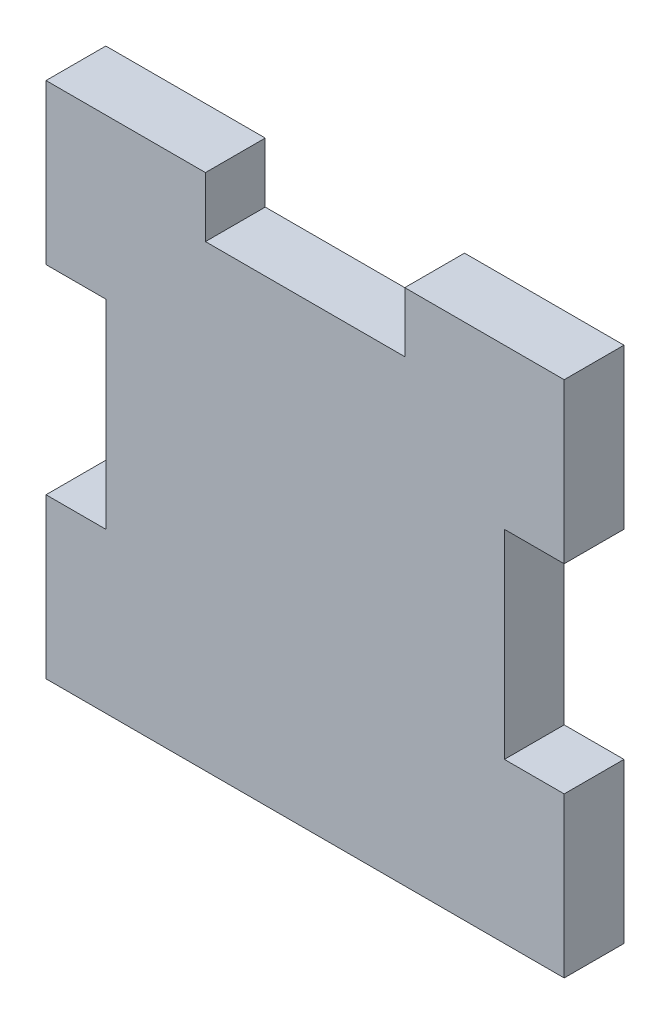
ISO-10303-21;
HEADER;
FILE_DESCRIPTION(('STEP AP214'),'2;1');
FILE_NAME('part.step','',(''),(''),'','','');
FILE_SCHEMA(('AUTOMOTIVE_DESIGN { 1 0 10303 214 1 1 1 1 }'));
ENDSEC;
DATA;
#1=APPLICATION_CONTEXT('core data for automotive mechanical design processes');
#2=APPLICATION_PROTOCOL_DEFINITION('international standard','automotive_design',2000,#1);
#3=PRODUCT_CONTEXT('',#1,'mechanical');
#4=PRODUCT('Part','Part','',(#3));
#5=PRODUCT_RELATED_PRODUCT_CATEGORY('part','',(#4));
#6=PRODUCT_DEFINITION_FORMATION('','',#4);
#7=PRODUCT_DEFINITION_CONTEXT('part definition',#1,'design');
#8=PRODUCT_DEFINITION('design','',#6,#7);
#9=PRODUCT_DEFINITION_SHAPE('','',#8);
#10=(LENGTH_UNIT() NAMED_UNIT(*) SI_UNIT(.MILLI.,.METRE.));
#11=(NAMED_UNIT(*) PLANE_ANGLE_UNIT() SI_UNIT($,.RADIAN.));
#12=(NAMED_UNIT(*) SI_UNIT($,.STERADIAN.) SOLID_ANGLE_UNIT());
#13=UNCERTAINTY_MEASURE_WITH_UNIT(LENGTH_MEASURE(1.E-05),#10,'distance_accuracy_value','');
#14=(GEOMETRIC_REPRESENTATION_CONTEXT(3) GLOBAL_UNCERTAINTY_ASSIGNED_CONTEXT((#13)) GLOBAL_UNIT_ASSIGNED_CONTEXT((#10,
#11,#12)) REPRESENTATION_CONTEXT('',''));
#15=CARTESIAN_POINT('',(0.,0.,0.));
#16=DIRECTION('',(0.,0.,1.));
#17=DIRECTION('',(1.,0.,0.));
#18=AXIS2_PLACEMENT_3D('',#15,#16,#17);
#19=CARTESIAN_POINT('',(0.,0.,3.));
#20=DIRECTION('',(1.,0.,0.));
#21=DIRECTION('',(0.,0.,-1.));
#22=AXIS2_PLACEMENT_3D('',#19,#20,#21);
#23=PLANE('',#22);
#24=DIRECTION('',(0.,-1.,0.));
#25=VECTOR('',#24,1.);
#26=CARTESIAN_POINT('',(0.,0.,0.));
#27=LINE('',#26,#25);
#28=CARTESIAN_POINT('',(0.,8.,0.));
#29=VERTEX_POINT('',#28);
#30=CARTESIAN_POINT('',(0.,0.,0.));
#31=VERTEX_POINT('',#30);
#32=EDGE_CURVE('E177',#29,#31,#27,.T.);
#33=ORIENTED_EDGE('',*,*,#32,.T.);
#34=DIRECTION('',(0.,0.,-1.));
#35=VECTOR('',#34,1.);
#36=CARTESIAN_POINT('',(0.,0.,3.));
#37=LINE('',#36,#35);
#38=CARTESIAN_POINT('',(0.,0.,3.));
#39=VERTEX_POINT('',#38);
#40=EDGE_CURVE('E11',#39,#31,#37,.T.);
#41=ORIENTED_EDGE('',*,*,#40,.F.);
#42=DIRECTION('',(0.,-1.,0.));
#43=VECTOR('',#42,1.);
#44=CARTESIAN_POINT('',(0.,0.,3.));
#45=LINE('',#44,#43);
#46=CARTESIAN_POINT('',(0.,8.,3.));
#47=VERTEX_POINT('',#46);
#48=EDGE_CURVE('E207',#47,#39,#45,.T.);
#49=ORIENTED_EDGE('',*,*,#48,.F.);
#50=DIRECTION('',(0.,0.,-1.));
#51=VECTOR('',#50,1.);
#52=CARTESIAN_POINT('',(0.,8.,3.));
#53=LINE('',#52,#51);
#54=EDGE_CURVE('E173',#47,#29,#53,.T.);
#55=ORIENTED_EDGE('',*,*,#54,.T.);
#56=EDGE_LOOP('',(#33,#41,#49,#55));
#57=FACE_BOUND('',#56,.T.);
#58=ADVANCED_FACE('F33',(#57),#23,.F.);
#59=CARTESIAN_POINT('',(0.,0.,3.));
#60=DIRECTION('',(0.,1.,0.));
#61=DIRECTION('',(0.,0.,1.));
#62=AXIS2_PLACEMENT_3D('',#59,#60,#61);
#63=PLANE('',#62);
#64=DIRECTION('',(1.,0.,0.));
#65=VECTOR('',#64,1.);
#66=CARTESIAN_POINT('',(0.,0.,0.));
#67=LINE('',#66,#65);
#68=CARTESIAN_POINT('',(26.,0.,0.));
#69=VERTEX_POINT('',#68);
#70=EDGE_CURVE('E180',#31,#69,#67,.T.);
#71=ORIENTED_EDGE('',*,*,#70,.T.);
#72=DIRECTION('',(0.,0.,-1.));
#73=VECTOR('',#72,1.);
#74=CARTESIAN_POINT('',(26.,0.,3.));
#75=LINE('',#74,#73);
#76=CARTESIAN_POINT('',(26.,0.,3.));
#77=VERTEX_POINT('',#76);
#78=EDGE_CURVE('E41',#77,#69,#75,.T.);
#79=ORIENTED_EDGE('',*,*,#78,.F.);
#80=DIRECTION('',(1.,0.,0.));
#81=VECTOR('',#80,1.);
#82=CARTESIAN_POINT('',(0.,0.,3.));
#83=LINE('',#82,#81);
#84=EDGE_CURVE('E116',#39,#77,#83,.T.);
#85=ORIENTED_EDGE('',*,*,#84,.F.);
#86=ORIENTED_EDGE('',*,*,#40,.T.);
#87=EDGE_LOOP('',(#71,#79,#85,#86));
#88=FACE_BOUND('',#87,.T.);
#89=ADVANCED_FACE('F305',(#88),#63,.F.);
#90=CARTESIAN_POINT('',(26.,0.,3.));
#91=DIRECTION('',(-1.,0.,0.));
#92=DIRECTION('',(0.,-1.,0.));
#93=AXIS2_PLACEMENT_3D('',#90,#91,#92);
#94=PLANE('',#93);
#95=DIRECTION('',(0.,1.,0.));
#96=VECTOR('',#95,1.);
#97=CARTESIAN_POINT('',(26.,0.,0.));
#98=LINE('',#97,#96);
#99=CARTESIAN_POINT('',(26.,8.,0.));
#100=VERTEX_POINT('',#99);
#101=EDGE_CURVE('E182',#69,#100,#98,.T.);
#102=ORIENTED_EDGE('',*,*,#101,.T.);
#103=DIRECTION('',(0.,0.,-1.));
#104=VECTOR('',#103,1.);
#105=CARTESIAN_POINT('',(26.,8.,3.));
#106=LINE('',#105,#104);
#107=CARTESIAN_POINT('',(26.,8.,3.));
#108=VERTEX_POINT('',#107);
#109=EDGE_CURVE('E238',#108,#100,#106,.T.);
#110=ORIENTED_EDGE('',*,*,#109,.F.);
#111=DIRECTION('',(0.,1.,0.));
#112=VECTOR('',#111,1.);
#113=CARTESIAN_POINT('',(26.,0.,3.));
#114=LINE('',#113,#112);
#115=EDGE_CURVE('E246',#77,#108,#114,.T.);
#116=ORIENTED_EDGE('',*,*,#115,.F.);
#117=ORIENTED_EDGE('',*,*,#78,.T.);
#118=EDGE_LOOP('',(#102,#110,#116,#117));
#119=FACE_BOUND('',#118,.T.);
#120=ADVANCED_FACE('F244',(#119),#94,.F.);
#121=CARTESIAN_POINT('',(26.,8.,3.));
#122=DIRECTION('',(0.,-1.,0.));
#123=DIRECTION('',(0.,0.,-1.));
#124=AXIS2_PLACEMENT_3D('',#121,#122,#123);
#125=PLANE('',#124);
#126=DIRECTION('',(-1.,0.,0.));
#127=VECTOR('',#126,1.);
#128=CARTESIAN_POINT('',(26.,8.,0.));
#129=LINE('',#128,#127);
#130=CARTESIAN_POINT('',(23.,8.,0.));
#131=VERTEX_POINT('',#130);
#132=EDGE_CURVE('E184',#100,#131,#129,.T.);
#133=ORIENTED_EDGE('',*,*,#132,.T.);
#134=DIRECTION('',(0.,0.,-1.));
#135=VECTOR('',#134,1.);
#136=CARTESIAN_POINT('',(23.,8.,3.));
#137=LINE('',#136,#135);
#138=CARTESIAN_POINT('',(23.,8.,3.));
#139=VERTEX_POINT('',#138);
#140=EDGE_CURVE('E235',#139,#131,#137,.T.);
#141=ORIENTED_EDGE('',*,*,#140,.F.);
#142=DIRECTION('',(-1.,0.,0.));
#143=VECTOR('',#142,1.);
#144=CARTESIAN_POINT('',(26.,8.,3.));
#145=LINE('',#144,#143);
#146=EDGE_CURVE('E264',#108,#139,#145,.T.);
#147=ORIENTED_EDGE('',*,*,#146,.F.);
#148=ORIENTED_EDGE('',*,*,#109,.T.);
#149=EDGE_LOOP('',(#133,#141,#147,#148));
#150=FACE_BOUND('',#149,.T.);
#151=ADVANCED_FACE('F255',(#150),#125,.F.);
#152=CARTESIAN_POINT('',(23.,18.,3.));
#153=DIRECTION('',(-1.,0.,0.));
#154=DIRECTION('',(0.,0.,1.));
#155=AXIS2_PLACEMENT_3D('',#152,#153,#154);
#156=PLANE('',#155);
#157=DIRECTION('',(0.,1.,0.));
#158=VECTOR('',#157,1.);
#159=CARTESIAN_POINT('',(23.,18.,0.));
#160=LINE('',#159,#158);
#161=CARTESIAN_POINT('',(23.,18.,0.));
#162=VERTEX_POINT('',#161);
#163=EDGE_CURVE('E186',#131,#162,#160,.T.);
#164=ORIENTED_EDGE('',*,*,#163,.T.);
#165=DIRECTION('',(0.,0.,-1.));
#166=VECTOR('',#165,1.);
#167=CARTESIAN_POINT('',(23.,18.,3.));
#168=LINE('',#167,#166);
#169=CARTESIAN_POINT('',(23.,18.,3.));
#170=VERTEX_POINT('',#169);
#171=EDGE_CURVE('E232',#170,#162,#168,.T.);
#172=ORIENTED_EDGE('',*,*,#171,.F.);
#173=DIRECTION('',(0.,1.,0.));
#174=VECTOR('',#173,1.);
#175=CARTESIAN_POINT('',(23.,18.,3.));
#176=LINE('',#175,#174);
#177=EDGE_CURVE('E261',#139,#170,#176,.T.);
#178=ORIENTED_EDGE('',*,*,#177,.F.);
#179=ORIENTED_EDGE('',*,*,#140,.T.);
#180=EDGE_LOOP('',(#164,#172,#178,#179));
#181=FACE_BOUND('',#180,.T.);
#182=ADVANCED_FACE('F259',(#181),#156,.F.);
#183=CARTESIAN_POINT('',(26.,18.,3.));
#184=DIRECTION('',(0.,1.,0.));
#185=DIRECTION('',(0.,0.,1.));
#186=AXIS2_PLACEMENT_3D('',#183,#184,#185);
#187=PLANE('',#186);
#188=DIRECTION('',(1.,0.,0.));
#189=VECTOR('',#188,1.);
#190=CARTESIAN_POINT('',(26.,18.,0.));
#191=LINE('',#190,#189);
#192=CARTESIAN_POINT('',(26.,18.,0.));
#193=VERTEX_POINT('',#192);
#194=EDGE_CURVE('E188',#162,#193,#191,.T.);
#195=ORIENTED_EDGE('',*,*,#194,.T.);
#196=DIRECTION('',(0.,0.,-1.));
#197=VECTOR('',#196,1.);
#198=CARTESIAN_POINT('',(26.,18.,3.));
#199=LINE('',#198,#197);
#200=CARTESIAN_POINT('',(26.,18.,3.));
#201=VERTEX_POINT('',#200);
#202=EDGE_CURVE('E229',#201,#193,#199,.T.);
#203=ORIENTED_EDGE('',*,*,#202,.F.);
#204=DIRECTION('',(1.,0.,0.));
#205=VECTOR('',#204,1.);
#206=CARTESIAN_POINT('',(26.,18.,3.));
#207=LINE('',#206,#205);
#208=EDGE_CURVE('E263',#170,#201,#207,.T.);
#209=ORIENTED_EDGE('',*,*,#208,.F.);
#210=ORIENTED_EDGE('',*,*,#171,.T.);
#211=EDGE_LOOP('',(#195,#203,#209,#210));
#212=FACE_BOUND('',#211,.T.);
#213=ADVANCED_FACE('F318',(#212),#187,.F.);
#214=CARTESIAN_POINT('',(26.,18.,3.));
#215=DIRECTION('',(-1.,0.,0.));
#216=DIRECTION('',(0.,0.,1.));
#217=AXIS2_PLACEMENT_3D('',#214,#215,#216);
#218=PLANE('',#217);
#219=DIRECTION('',(0.,1.,0.));
#220=VECTOR('',#219,1.);
#221=CARTESIAN_POINT('',(26.,18.,0.));
#222=LINE('',#221,#220);
#223=CARTESIAN_POINT('',(26.,26.,0.));
#224=VERTEX_POINT('',#223);
#225=EDGE_CURVE('E190',#193,#224,#222,.T.);
#226=ORIENTED_EDGE('',*,*,#225,.T.);
#227=DIRECTION('',(0.,0.,-1.));
#228=VECTOR('',#227,1.);
#229=CARTESIAN_POINT('',(26.,26.,3.));
#230=LINE('',#229,#228);
#231=CARTESIAN_POINT('',(26.,26.,3.));
#232=VERTEX_POINT('',#231);
#233=EDGE_CURVE('E226',#232,#224,#230,.T.);
#234=ORIENTED_EDGE('',*,*,#233,.F.);
#235=DIRECTION('',(0.,1.,0.));
#236=VECTOR('',#235,1.);
#237=CARTESIAN_POINT('',(26.,18.,3.));
#238=LINE('',#237,#236);
#239=EDGE_CURVE('E266',#201,#232,#238,.T.);
#240=ORIENTED_EDGE('',*,*,#239,.F.);
#241=ORIENTED_EDGE('',*,*,#202,.T.);
#242=EDGE_LOOP('',(#226,#234,#240,#241));
#243=FACE_BOUND('',#242,.T.);
#244=ADVANCED_FACE('F321',(#243),#218,.F.);
#245=CARTESIAN_POINT('',(18.,26.,3.));
#246=DIRECTION('',(0.,-1.,0.));
#247=DIRECTION('',(0.,0.,-1.));
#248=AXIS2_PLACEMENT_3D('',#245,#246,#247);
#249=PLANE('',#248);
#250=DIRECTION('',(-1.,0.,0.));
#251=VECTOR('',#250,1.);
#252=CARTESIAN_POINT('',(18.,26.,0.));
#253=LINE('',#252,#251);
#254=CARTESIAN_POINT('',(18.,26.,0.));
#255=VERTEX_POINT('',#254);
#256=EDGE_CURVE('E192',#224,#255,#253,.T.);
#257=ORIENTED_EDGE('',*,*,#256,.T.);
#258=DIRECTION('',(0.,0.,-1.));
#259=VECTOR('',#258,1.);
#260=CARTESIAN_POINT('',(18.,26.,3.));
#261=LINE('',#260,#259);
#262=CARTESIAN_POINT('',(18.,26.,3.));
#263=VERTEX_POINT('',#262);
#264=EDGE_CURVE('E223',#263,#255,#261,.T.);
#265=ORIENTED_EDGE('',*,*,#264,.F.);
#266=DIRECTION('',(-1.,0.,0.));
#267=VECTOR('',#266,1.);
#268=CARTESIAN_POINT('',(18.,26.,3.));
#269=LINE('',#268,#267);
#270=EDGE_CURVE('E272',#232,#263,#269,.T.);
#271=ORIENTED_EDGE('',*,*,#270,.F.);
#272=ORIENTED_EDGE('',*,*,#233,.T.);
#273=EDGE_LOOP('',(#257,#265,#271,#272));
#274=FACE_BOUND('',#273,.T.);
#275=ADVANCED_FACE('F325',(#274),#249,.F.);
#276=CARTESIAN_POINT('',(18.,26.,3.));
#277=DIRECTION('',(1.,0.,0.));
#278=DIRECTION('',(0.,0.,-1.));
#279=AXIS2_PLACEMENT_3D('',#276,#277,#278);
#280=PLANE('',#279);
#281=DIRECTION('',(0.,-1.,0.));
#282=VECTOR('',#281,1.);
#283=CARTESIAN_POINT('',(18.,26.,0.));
#284=LINE('',#283,#282);
#285=CARTESIAN_POINT('',(18.,23.,0.));
#286=VERTEX_POINT('',#285);
#287=EDGE_CURVE('E194',#255,#286,#284,.T.);
#288=ORIENTED_EDGE('',*,*,#287,.T.);
#289=DIRECTION('',(0.,0.,-1.));
#290=VECTOR('',#289,1.);
#291=CARTESIAN_POINT('',(18.,23.,3.));
#292=LINE('',#291,#290);
#293=CARTESIAN_POINT('',(18.,23.,3.));
#294=VERTEX_POINT('',#293);
#295=EDGE_CURVE('E220',#294,#286,#292,.T.);
#296=ORIENTED_EDGE('',*,*,#295,.F.);
#297=DIRECTION('',(0.,-1.,0.));
#298=VECTOR('',#297,1.);
#299=CARTESIAN_POINT('',(18.,26.,3.));
#300=LINE('',#299,#298);
#301=EDGE_CURVE('E274',#263,#294,#300,.T.);
#302=ORIENTED_EDGE('',*,*,#301,.F.);
#303=ORIENTED_EDGE('',*,*,#264,.T.);
#304=EDGE_LOOP('',(#288,#296,#302,#303));
#305=FACE_BOUND('',#304,.T.);
#306=ADVANCED_FACE('F329',(#305),#280,.F.);
#307=CARTESIAN_POINT('',(8.,23.,3.));
#308=DIRECTION('',(0.,-1.,0.));
#309=DIRECTION('',(0.,0.,-1.));
#310=AXIS2_PLACEMENT_3D('',#307,#308,#309);
#311=PLANE('',#310);
#312=DIRECTION('',(-1.,0.,0.));
#313=VECTOR('',#312,1.);
#314=CARTESIAN_POINT('',(8.,23.,0.));
#315=LINE('',#314,#313);
#316=CARTESIAN_POINT('',(8.,23.,0.));
#317=VERTEX_POINT('',#316);
#318=EDGE_CURVE('E196',#286,#317,#315,.T.);
#319=ORIENTED_EDGE('',*,*,#318,.T.);
#320=DIRECTION('',(0.,0.,-1.));
#321=VECTOR('',#320,1.);
#322=CARTESIAN_POINT('',(8.,23.,3.));
#323=LINE('',#322,#321);
#324=CARTESIAN_POINT('',(8.,23.,3.));
#325=VERTEX_POINT('',#324);
#326=EDGE_CURVE('E217',#325,#317,#323,.T.);
#327=ORIENTED_EDGE('',*,*,#326,.F.);
#328=DIRECTION('',(-1.,0.,0.));
#329=VECTOR('',#328,1.);
#330=CARTESIAN_POINT('',(8.,23.,3.));
#331=LINE('',#330,#329);
#332=EDGE_CURVE('E276',#294,#325,#331,.T.);
#333=ORIENTED_EDGE('',*,*,#332,.F.);
#334=ORIENTED_EDGE('',*,*,#295,.T.);
#335=EDGE_LOOP('',(#319,#327,#333,#334));
#336=FACE_BOUND('',#335,.T.);
#337=ADVANCED_FACE('F333',(#336),#311,.F.);
#338=CARTESIAN_POINT('',(8.,26.,3.));
#339=DIRECTION('',(-1.,0.,0.));
#340=DIRECTION('',(0.,0.,1.));
#341=AXIS2_PLACEMENT_3D('',#338,#339,#340);
#342=PLANE('',#341);
#343=DIRECTION('',(0.,1.,0.));
#344=VECTOR('',#343,1.);
#345=CARTESIAN_POINT('',(8.,26.,0.));
#346=LINE('',#345,#344);
#347=CARTESIAN_POINT('',(8.,26.,0.));
#348=VERTEX_POINT('',#347);
#349=EDGE_CURVE('E198',#317,#348,#346,.T.);
#350=ORIENTED_EDGE('',*,*,#349,.T.);
#351=DIRECTION('',(0.,0.,-1.));
#352=VECTOR('',#351,1.);
#353=CARTESIAN_POINT('',(8.,26.,3.));
#354=LINE('',#353,#352);
#355=CARTESIAN_POINT('',(8.,26.,3.));
#356=VERTEX_POINT('',#355);
#357=EDGE_CURVE('E214',#356,#348,#354,.T.);
#358=ORIENTED_EDGE('',*,*,#357,.F.);
#359=DIRECTION('',(0.,1.,0.));
#360=VECTOR('',#359,1.);
#361=CARTESIAN_POINT('',(8.,26.,3.));
#362=LINE('',#361,#360);
#363=EDGE_CURVE('E278',#325,#356,#362,.T.);
#364=ORIENTED_EDGE('',*,*,#363,.F.);
#365=ORIENTED_EDGE('',*,*,#326,.T.);
#366=EDGE_LOOP('',(#350,#358,#364,#365));
#367=FACE_BOUND('',#366,.T.);
#368=ADVANCED_FACE('F337',(#367),#342,.F.);
#369=CARTESIAN_POINT('',(0.,26.,3.));
#370=DIRECTION('',(0.,-1.,0.));
#371=DIRECTION('',(0.,0.,-1.));
#372=AXIS2_PLACEMENT_3D('',#369,#370,#371);
#373=PLANE('',#372);
#374=DIRECTION('',(-1.,0.,0.));
#375=VECTOR('',#374,1.);
#376=CARTESIAN_POINT('',(0.,26.,0.));
#377=LINE('',#376,#375);
#378=CARTESIAN_POINT('',(0.,26.,0.));
#379=VERTEX_POINT('',#378);
#380=EDGE_CURVE('E200',#348,#379,#377,.T.);
#381=ORIENTED_EDGE('',*,*,#380,.T.);
#382=DIRECTION('',(0.,0.,-1.));
#383=VECTOR('',#382,1.);
#384=CARTESIAN_POINT('',(0.,26.,3.));
#385=LINE('',#384,#383);
#386=CARTESIAN_POINT('',(0.,26.,3.));
#387=VERTEX_POINT('',#386);
#388=EDGE_CURVE('E211',#387,#379,#385,.T.);
#389=ORIENTED_EDGE('',*,*,#388,.F.);
#390=DIRECTION('',(-1.,0.,0.));
#391=VECTOR('',#390,1.);
#392=CARTESIAN_POINT('',(0.,26.,3.));
#393=LINE('',#392,#391);
#394=EDGE_CURVE('E280',#356,#387,#393,.T.);
#395=ORIENTED_EDGE('',*,*,#394,.F.);
#396=ORIENTED_EDGE('',*,*,#357,.T.);
#397=EDGE_LOOP('',(#381,#389,#395,#396));
#398=FACE_BOUND('',#397,.T.);
#399=ADVANCED_FACE('F286',(#398),#373,.F.);
#400=CARTESIAN_POINT('',(0.,18.,3.));
#401=DIRECTION('',(1.,0.,0.));
#402=DIRECTION('',(0.,1.,0.));
#403=AXIS2_PLACEMENT_3D('',#400,#401,#402);
#404=PLANE('',#403);
#405=DIRECTION('',(0.,-1.,0.));
#406=VECTOR('',#405,1.);
#407=CARTESIAN_POINT('',(0.,18.,0.));
#408=LINE('',#407,#406);
#409=CARTESIAN_POINT('',(0.,18.,0.));
#410=VERTEX_POINT('',#409);
#411=EDGE_CURVE('E202',#379,#410,#408,.T.);
#412=ORIENTED_EDGE('',*,*,#411,.T.);
#413=DIRECTION('',(0.,0.,-1.));
#414=VECTOR('',#413,1.);
#415=CARTESIAN_POINT('',(0.,18.,3.));
#416=LINE('',#415,#414);
#417=CARTESIAN_POINT('',(0.,18.,3.));
#418=VERTEX_POINT('',#417);
#419=EDGE_CURVE('E168',#418,#410,#416,.T.);
#420=ORIENTED_EDGE('',*,*,#419,.F.);
#421=DIRECTION('',(0.,-1.,0.));
#422=VECTOR('',#421,1.);
#423=CARTESIAN_POINT('',(0.,18.,3.));
#424=LINE('',#423,#422);
#425=EDGE_CURVE('E159',#387,#418,#424,.T.);
#426=ORIENTED_EDGE('',*,*,#425,.F.);
#427=ORIENTED_EDGE('',*,*,#388,.T.);
#428=EDGE_LOOP('',(#412,#420,#426,#427));
#429=FACE_BOUND('',#428,.T.);
#430=ADVANCED_FACE('F290',(#429),#404,.F.);
#431=CARTESIAN_POINT('',(0.,18.,3.));
#432=DIRECTION('',(0.,1.,0.));
#433=DIRECTION('',(0.,0.,1.));
#434=AXIS2_PLACEMENT_3D('',#431,#432,#433);
#435=PLANE('',#434);
#436=DIRECTION('',(1.,0.,0.));
#437=VECTOR('',#436,1.);
#438=CARTESIAN_POINT('',(0.,18.,0.));
#439=LINE('',#438,#437);
#440=CARTESIAN_POINT('',(3.,18.,0.));
#441=VERTEX_POINT('',#440);
#442=EDGE_CURVE('E167',#410,#441,#439,.T.);
#443=ORIENTED_EDGE('',*,*,#442,.T.);
#444=DIRECTION('',(0.,0.,-1.));
#445=VECTOR('',#444,1.);
#446=CARTESIAN_POINT('',(3.,18.,3.));
#447=LINE('',#446,#445);
#448=CARTESIAN_POINT('',(3.,18.,3.));
#449=VERTEX_POINT('',#448);
#450=EDGE_CURVE('E164',#449,#441,#447,.T.);
#451=ORIENTED_EDGE('',*,*,#450,.F.);
#452=DIRECTION('',(1.,0.,0.));
#453=VECTOR('',#452,1.);
#454=CARTESIAN_POINT('',(0.,18.,3.));
#455=LINE('',#454,#453);
#456=EDGE_CURVE('E153',#418,#449,#455,.T.);
#457=ORIENTED_EDGE('',*,*,#456,.F.);
#458=ORIENTED_EDGE('',*,*,#419,.T.);
#459=EDGE_LOOP('',(#443,#451,#457,#458));
#460=FACE_BOUND('',#459,.T.);
#461=ADVANCED_FACE('F165',(#460),#435,.F.);
#462=CARTESIAN_POINT('',(3.,18.,3.));
#463=DIRECTION('',(1.,0.,0.));
#464=DIRECTION('',(0.,0.,-1.));
#465=AXIS2_PLACEMENT_3D('',#462,#463,#464);
#466=PLANE('',#465);
#467=DIRECTION('',(0.,-1.,0.));
#468=VECTOR('',#467,1.);
#469=CARTESIAN_POINT('',(3.,18.,0.));
#470=LINE('',#469,#468);
#471=CARTESIAN_POINT('',(3.,8.,0.));
#472=VERTEX_POINT('',#471);
#473=EDGE_CURVE('E102',#441,#472,#470,.T.);
#474=ORIENTED_EDGE('',*,*,#473,.T.);
#475=DIRECTION('',(0.,0.,-1.));
#476=VECTOR('',#475,1.);
#477=CARTESIAN_POINT('',(3.,8.,3.));
#478=LINE('',#477,#476);
#479=CARTESIAN_POINT('',(3.,8.,3.));
#480=VERTEX_POINT('',#479);
#481=EDGE_CURVE('E169',#480,#472,#478,.T.);
#482=ORIENTED_EDGE('',*,*,#481,.F.);
#483=DIRECTION('',(0.,-1.,0.));
#484=VECTOR('',#483,1.);
#485=CARTESIAN_POINT('',(3.,18.,3.));
#486=LINE('',#485,#484);
#487=EDGE_CURVE('E157',#449,#480,#486,.T.);
#488=ORIENTED_EDGE('',*,*,#487,.F.);
#489=ORIENTED_EDGE('',*,*,#450,.T.);
#490=EDGE_LOOP('',(#474,#482,#488,#489));
#491=FACE_BOUND('',#490,.T.);
#492=ADVANCED_FACE('F171',(#491),#466,.F.);
#493=CARTESIAN_POINT('',(0.,8.,3.));
#494=DIRECTION('',(0.,-1.,0.));
#495=DIRECTION('',(0.,0.,-1.));
#496=AXIS2_PLACEMENT_3D('',#493,#494,#495);
#497=PLANE('',#496);
#498=DIRECTION('',(-1.,0.,0.));
#499=VECTOR('',#498,1.);
#500=CARTESIAN_POINT('',(0.,8.,0.));
#501=LINE('',#500,#499);
#502=EDGE_CURVE('E108',#472,#29,#501,.T.);
#503=ORIENTED_EDGE('',*,*,#502,.T.);
#504=ORIENTED_EDGE('',*,*,#54,.F.);
#505=DIRECTION('',(-1.,0.,0.));
#506=VECTOR('',#505,1.);
#507=CARTESIAN_POINT('',(0.,8.,3.));
#508=LINE('',#507,#506);
#509=EDGE_CURVE('E49',#480,#47,#508,.T.);
#510=ORIENTED_EDGE('',*,*,#509,.F.);
#511=ORIENTED_EDGE('',*,*,#481,.T.);
#512=EDGE_LOOP('',(#503,#504,#510,#511));
#513=FACE_BOUND('',#512,.T.);
#514=ADVANCED_FACE('F294',(#513),#497,.F.);
#515=CARTESIAN_POINT('',(0.,0.,3.));
#516=DIRECTION('',(0.,0.,-1.));
#517=DIRECTION('',(-1.,0.,0.));
#518=AXIS2_PLACEMENT_3D('',#515,#516,#517);
#519=PLANE('',#518);
#520=ORIENTED_EDGE('',*,*,#48,.T.);
#521=ORIENTED_EDGE('',*,*,#84,.T.);
#522=ORIENTED_EDGE('',*,*,#115,.T.);
#523=ORIENTED_EDGE('',*,*,#146,.T.);
#524=ORIENTED_EDGE('',*,*,#177,.T.);
#525=ORIENTED_EDGE('',*,*,#208,.T.);
#526=ORIENTED_EDGE('',*,*,#239,.T.);
#527=ORIENTED_EDGE('',*,*,#270,.T.);
#528=ORIENTED_EDGE('',*,*,#301,.T.);
#529=ORIENTED_EDGE('',*,*,#332,.T.);
#530=ORIENTED_EDGE('',*,*,#363,.T.);
#531=ORIENTED_EDGE('',*,*,#394,.T.);
#532=ORIENTED_EDGE('',*,*,#425,.T.);
#533=ORIENTED_EDGE('',*,*,#456,.T.);
#534=ORIENTED_EDGE('',*,*,#487,.T.);
#535=ORIENTED_EDGE('',*,*,#509,.T.);
#536=EDGE_LOOP('',(#520,#521,#522,#523,#524,#525,#526,#527,#528,#529,#530,#531,#532,#533,#534,#535));
#537=FACE_BOUND('',#536,.T.);
#538=ADVANCED_FACE('F155',(#537),#519,.F.);
#539=CARTESIAN_POINT('',(0.,0.,0.));
#540=DIRECTION('',(0.,0.,-1.));
#541=DIRECTION('',(-1.,0.,0.));
#542=AXIS2_PLACEMENT_3D('',#539,#540,#541);
#543=PLANE('',#542);
#544=ORIENTED_EDGE('',*,*,#32,.F.);
#545=ORIENTED_EDGE('',*,*,#502,.F.);
#546=ORIENTED_EDGE('',*,*,#473,.F.);
#547=ORIENTED_EDGE('',*,*,#442,.F.);
#548=ORIENTED_EDGE('',*,*,#411,.F.);
#549=ORIENTED_EDGE('',*,*,#380,.F.);
#550=ORIENTED_EDGE('',*,*,#349,.F.);
#551=ORIENTED_EDGE('',*,*,#318,.F.);
#552=ORIENTED_EDGE('',*,*,#287,.F.);
#553=ORIENTED_EDGE('',*,*,#256,.F.);
#554=ORIENTED_EDGE('',*,*,#225,.F.);
#555=ORIENTED_EDGE('',*,*,#194,.F.);
#556=ORIENTED_EDGE('',*,*,#163,.F.);
#557=ORIENTED_EDGE('',*,*,#132,.F.);
#558=ORIENTED_EDGE('',*,*,#101,.F.);
#559=ORIENTED_EDGE('',*,*,#70,.F.);
#560=EDGE_LOOP('',(#544,#545,#546,#547,#548,#549,#550,#551,#552,#553,#554,#555,#556,#557,#558,#559));
#561=FACE_BOUND('',#560,.T.);
#562=ADVANCED_FACE('F250',(#561),#543,.T.);
#563=CLOSED_SHELL('',(#58,#89,#120,#151,#182,#213,#244,#275,#306,#337,#368,#399,#430,#461,#492,
#514,#538,#562));
#564=MANIFOLD_SOLID_BREP('B2',#563);
#565=ADVANCED_BREP_SHAPE_REPRESENTATION('',(#18,#564),#14);
#566=SHAPE_DEFINITION_REPRESENTATION(#9,#565);
ENDSEC;
END-ISO-10303-21;
